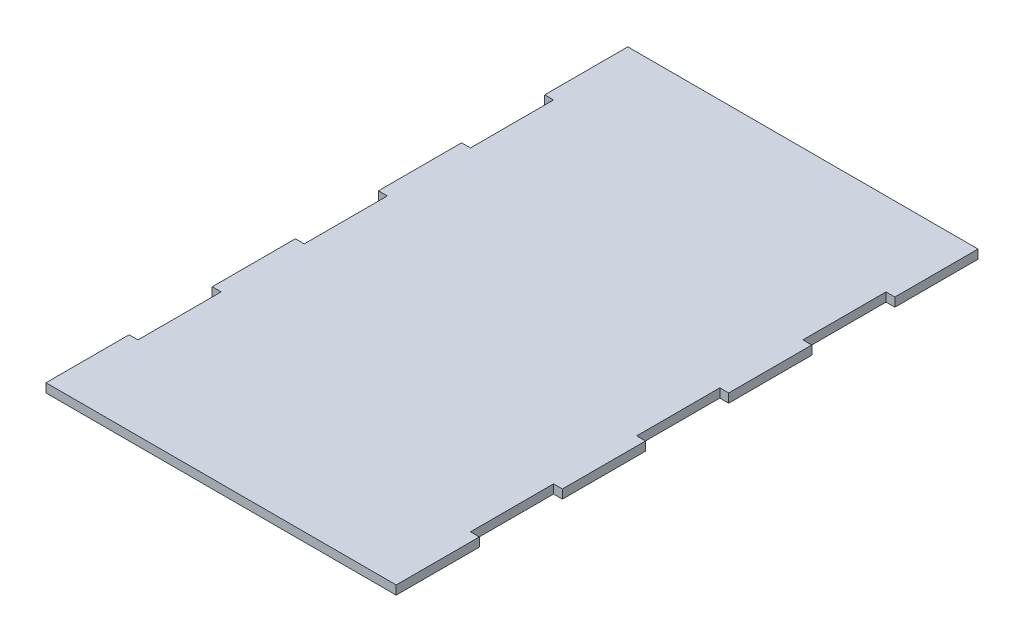
ISO-10303-21;
HEADER;
FILE_DESCRIPTION(('STEP AP214'),'2;1');
FILE_NAME('part.step','',(''),(''),'','','');
FILE_SCHEMA(('AUTOMOTIVE_DESIGN { 1 0 10303 214 1 1 1 1 }'));
ENDSEC;
DATA;
#1=APPLICATION_CONTEXT('core data for automotive mechanical design processes');
#2=APPLICATION_PROTOCOL_DEFINITION('international standard','automotive_design',2000,#1);
#3=PRODUCT_CONTEXT('',#1,'mechanical');
#4=PRODUCT('Part','Part','',(#3));
#5=PRODUCT_RELATED_PRODUCT_CATEGORY('part','',(#4));
#6=PRODUCT_DEFINITION_FORMATION('','',#4);
#7=PRODUCT_DEFINITION_CONTEXT('part definition',#1,'design');
#8=PRODUCT_DEFINITION('design','',#6,#7);
#9=PRODUCT_DEFINITION_SHAPE('','',#8);
#10=(LENGTH_UNIT() NAMED_UNIT(*) SI_UNIT(.MILLI.,.METRE.));
#11=(NAMED_UNIT(*) PLANE_ANGLE_UNIT() SI_UNIT($,.RADIAN.));
#12=(NAMED_UNIT(*) SI_UNIT($,.STERADIAN.) SOLID_ANGLE_UNIT());
#13=UNCERTAINTY_MEASURE_WITH_UNIT(LENGTH_MEASURE(1.E-05),#10,'distance_accuracy_value','');
#14=(GEOMETRIC_REPRESENTATION_CONTEXT(3) GLOBAL_UNCERTAINTY_ASSIGNED_CONTEXT((#13)) GLOBAL_UNIT_ASSIGNED_CONTEXT((#10,
#11,#12)) REPRESENTATION_CONTEXT('',''));
#15=CARTESIAN_POINT('',(0.,0.,0.));
#16=DIRECTION('',(0.,0.,1.));
#17=DIRECTION('',(1.,0.,0.));
#18=AXIS2_PLACEMENT_3D('',#15,#16,#17);
#19=CARTESIAN_POINT('',(0.,10.16,0.));
#20=DIRECTION('',(0.,0.,-1.));
#21=DIRECTION('',(-1.,0.,0.));
#22=AXIS2_PLACEMENT_3D('',#19,#20,#21);
#23=PLANE('',#22);
#24=DIRECTION('',(1.,0.,0.));
#25=VECTOR('',#24,1.);
#26=CARTESIAN_POINT('',(0.,0.,0.));
#27=LINE('',#26,#25);
#28=CARTESIAN_POINT('',(0.,0.,0.));
#29=VERTEX_POINT('',#28);
#30=CARTESIAN_POINT('',(401.32,0.,0.));
#31=VERTEX_POINT('',#30);
#32=EDGE_CURVE('E256',#29,#31,#27,.T.);
#33=ORIENTED_EDGE('',*,*,#32,.T.);
#34=DIRECTION('',(0.,-1.,0.));
#35=VECTOR('',#34,1.);
#36=CARTESIAN_POINT('',(401.32,10.16,0.));
#37=LINE('',#36,#35);
#38=CARTESIAN_POINT('',(401.32,10.16,0.));
#39=VERTEX_POINT('',#38);
#40=EDGE_CURVE('E11',#39,#31,#37,.T.);
#41=ORIENTED_EDGE('',*,*,#40,.F.);
#42=DIRECTION('',(1.,0.,0.));
#43=VECTOR('',#42,1.);
#44=CARTESIAN_POINT('',(0.,10.16,0.));
#45=LINE('',#44,#43);
#46=CARTESIAN_POINT('',(0.,10.16,0.));
#47=VERTEX_POINT('',#46);
#48=EDGE_CURVE('E323',#47,#39,#45,.T.);
#49=ORIENTED_EDGE('',*,*,#48,.F.);
#50=DIRECTION('',(0.,-1.,0.));
#51=VECTOR('',#50,1.);
#52=CARTESIAN_POINT('',(0.,10.16,0.));
#53=LINE('',#52,#51);
#54=EDGE_CURVE('E51',#47,#29,#53,.T.);
#55=ORIENTED_EDGE('',*,*,#54,.T.);
#56=EDGE_LOOP('',(#33,#41,#49,#55));
#57=FACE_BOUND('',#56,.T.);
#58=ADVANCED_FACE('F35',(#57),#23,.F.);
#59=CARTESIAN_POINT('',(401.32,10.16,0.));
#60=DIRECTION('',(-1.,0.,0.));
#61=DIRECTION('',(0.,0.,1.));
#62=AXIS2_PLACEMENT_3D('',#59,#60,#61);
#63=PLANE('',#62);
#64=DIRECTION('',(0.,0.,-1.));
#65=VECTOR('',#64,1.);
#66=CARTESIAN_POINT('',(401.32,0.,0.));
#67=LINE('',#66,#65);
#68=CARTESIAN_POINT('',(401.32,0.,-95.2500000000001));
#69=VERTEX_POINT('',#68);
#70=EDGE_CURVE('E258',#31,#69,#67,.T.);
#71=ORIENTED_EDGE('',*,*,#70,.T.);
#72=DIRECTION('',(0.,-1.,0.));
#73=VECTOR('',#72,1.);
#74=CARTESIAN_POINT('',(401.32,10.16,-95.2500000000001));
#75=LINE('',#74,#73);
#76=CARTESIAN_POINT('',(401.32,10.16,-95.2500000000001));
#77=VERTEX_POINT('',#76);
#78=EDGE_CURVE('E43',#77,#69,#75,.T.);
#79=ORIENTED_EDGE('',*,*,#78,.F.);
#80=DIRECTION('',(0.,0.,-1.));
#81=VECTOR('',#80,1.);
#82=CARTESIAN_POINT('',(401.32,10.16,0.));
#83=LINE('',#82,#81);
#84=EDGE_CURVE('E149',#39,#77,#83,.T.);
#85=ORIENTED_EDGE('',*,*,#84,.F.);
#86=ORIENTED_EDGE('',*,*,#40,.T.);
#87=EDGE_LOOP('',(#71,#79,#85,#86));
#88=FACE_BOUND('',#87,.T.);
#89=ADVANCED_FACE('F467',(#88),#63,.F.);
#90=CARTESIAN_POINT('',(-1.30104260698259E-13,10.16,-95.2499999999995));
#91=DIRECTION('',(0.,0.,1.));
#92=DIRECTION('',(1.,0.,0.));
#93=AXIS2_PLACEMENT_3D('',#90,#91,#92);
#94=PLANE('',#93);
#95=DIRECTION('',(-1.,0.,0.));
#96=VECTOR('',#95,1.);
#97=CARTESIAN_POINT('',(-1.30104260698259E-13,0.,-95.2499999999995));
#98=LINE('',#97,#96);
#99=CARTESIAN_POINT('',(391.16,0.,-95.25));
#100=VERTEX_POINT('',#99);
#101=EDGE_CURVE('E260',#69,#100,#98,.T.);
#102=ORIENTED_EDGE('',*,*,#101,.T.);
#103=DIRECTION('',(0.,-1.,0.));
#104=VECTOR('',#103,1.);
#105=CARTESIAN_POINT('',(391.16,10.16,-95.25));
#106=LINE('',#105,#104);
#107=CARTESIAN_POINT('',(391.16,10.16,-95.25));
#108=VERTEX_POINT('',#107);
#109=EDGE_CURVE('E373',#108,#100,#106,.T.);
#110=ORIENTED_EDGE('',*,*,#109,.F.);
#111=DIRECTION('',(-1.,0.,0.));
#112=VECTOR('',#111,1.);
#113=CARTESIAN_POINT('',(-1.30104260698259E-13,10.16,-95.2499999999995));
#114=LINE('',#113,#112);
#115=EDGE_CURVE('E380',#77,#108,#114,.T.);
#116=ORIENTED_EDGE('',*,*,#115,.F.);
#117=ORIENTED_EDGE('',*,*,#78,.T.);
#118=EDGE_LOOP('',(#102,#110,#116,#117));
#119=FACE_BOUND('',#118,.T.);
#120=ADVANCED_FACE('F378',(#119),#94,.F.);
#121=CARTESIAN_POINT('',(391.16,10.16,0.));
#122=DIRECTION('',(1.,0.,0.));
#123=DIRECTION('',(0.,0.,-1.));
#124=AXIS2_PLACEMENT_3D('',#121,#122,#123);
#125=PLANE('',#124);
#126=DIRECTION('',(0.,0.,1.));
#127=VECTOR('',#126,1.);
#128=CARTESIAN_POINT('',(391.16,0.,0.));
#129=LINE('',#128,#127);
#130=CARTESIAN_POINT('',(391.16,0.,-190.5));
#131=VERTEX_POINT('',#130);
#132=EDGE_CURVE('E263',#131,#100,#129,.T.);
#133=ORIENTED_EDGE('',*,*,#132,.F.);
#134=DIRECTION('',(0.,-1.,0.));
#135=VECTOR('',#134,1.);
#136=CARTESIAN_POINT('',(391.16,10.16,-190.5));
#137=LINE('',#136,#135);
#138=CARTESIAN_POINT('',(391.16,10.16,-190.5));
#139=VERTEX_POINT('',#138);
#140=EDGE_CURVE('E371',#139,#131,#137,.T.);
#141=ORIENTED_EDGE('',*,*,#140,.F.);
#142=DIRECTION('',(0.,0.,1.));
#143=VECTOR('',#142,1.);
#144=CARTESIAN_POINT('',(391.16,10.16,0.));
#145=LINE('',#144,#143);
#146=EDGE_CURVE('E390',#139,#108,#145,.T.);
#147=ORIENTED_EDGE('',*,*,#146,.T.);
#148=ORIENTED_EDGE('',*,*,#109,.T.);
#149=EDGE_LOOP('',(#133,#141,#147,#148));
#150=FACE_BOUND('',#149,.T.);
#151=ADVANCED_FACE('F387',(#150),#125,.T.);
#152=CARTESIAN_POINT('',(0.,10.16,-190.5));
#153=DIRECTION('',(0.,0.,1.));
#154=DIRECTION('',(1.,0.,0.));
#155=AXIS2_PLACEMENT_3D('',#152,#153,#154);
#156=PLANE('',#155);
#157=DIRECTION('',(-1.,0.,0.));
#158=VECTOR('',#157,1.);
#159=CARTESIAN_POINT('',(0.,0.,-190.5));
#160=LINE('',#159,#158);
#161=CARTESIAN_POINT('',(401.32,0.,-190.5));
#162=VERTEX_POINT('',#161);
#163=EDGE_CURVE('E266',#162,#131,#160,.T.);
#164=ORIENTED_EDGE('',*,*,#163,.F.);
#165=DIRECTION('',(0.,-1.,0.));
#166=VECTOR('',#165,1.);
#167=CARTESIAN_POINT('',(401.32,10.16,-190.5));
#168=LINE('',#167,#166);
#169=CARTESIAN_POINT('',(401.32,10.16,-190.5));
#170=VERTEX_POINT('',#169);
#171=EDGE_CURVE('E369',#170,#162,#168,.T.);
#172=ORIENTED_EDGE('',*,*,#171,.F.);
#173=DIRECTION('',(-1.,0.,0.));
#174=VECTOR('',#173,1.);
#175=CARTESIAN_POINT('',(0.,10.16,-190.5));
#176=LINE('',#175,#174);
#177=EDGE_CURVE('E393',#170,#139,#176,.T.);
#178=ORIENTED_EDGE('',*,*,#177,.T.);
#179=ORIENTED_EDGE('',*,*,#140,.T.);
#180=EDGE_LOOP('',(#164,#172,#178,#179));
#181=FACE_BOUND('',#180,.T.);
#182=ADVANCED_FACE('F720',(#181),#156,.T.);
#183=CARTESIAN_POINT('',(401.32,10.16,0.));
#184=DIRECTION('',(-1.,0.,0.));
#185=DIRECTION('',(0.,0.,1.));
#186=AXIS2_PLACEMENT_3D('',#183,#184,#185);
#187=PLANE('',#186);
#188=DIRECTION('',(0.,0.,-1.));
#189=VECTOR('',#188,1.);
#190=CARTESIAN_POINT('',(401.32,0.,0.));
#191=LINE('',#190,#189);
#192=CARTESIAN_POINT('',(401.32,0.,-285.75));
#193=VERTEX_POINT('',#192);
#194=EDGE_CURVE('E271',#162,#193,#191,.T.);
#195=ORIENTED_EDGE('',*,*,#194,.T.);
#196=DIRECTION('',(0.,-1.,0.));
#197=VECTOR('',#196,1.);
#198=CARTESIAN_POINT('',(401.32,10.16,-285.75));
#199=LINE('',#198,#197);
#200=CARTESIAN_POINT('',(401.32,10.16,-285.75));
#201=VERTEX_POINT('',#200);
#202=EDGE_CURVE('E366',#201,#193,#199,.T.);
#203=ORIENTED_EDGE('',*,*,#202,.F.);
#204=DIRECTION('',(0.,0.,-1.));
#205=VECTOR('',#204,1.);
#206=CARTESIAN_POINT('',(401.32,10.16,0.));
#207=LINE('',#206,#205);
#208=EDGE_CURVE('E397',#170,#201,#207,.T.);
#209=ORIENTED_EDGE('',*,*,#208,.F.);
#210=ORIENTED_EDGE('',*,*,#171,.T.);
#211=EDGE_LOOP('',(#195,#203,#209,#210));
#212=FACE_BOUND('',#211,.T.);
#213=ADVANCED_FACE('F708',(#212),#187,.F.);
#214=CARTESIAN_POINT('',(0.,10.16,-285.75));
#215=DIRECTION('',(0.,0.,1.));
#216=DIRECTION('',(1.,0.,0.));
#217=AXIS2_PLACEMENT_3D('',#214,#215,#216);
#218=PLANE('',#217);
#219=DIRECTION('',(-1.,0.,0.));
#220=VECTOR('',#219,1.);
#221=CARTESIAN_POINT('',(0.,0.,-285.75));
#222=LINE('',#221,#220);
#223=CARTESIAN_POINT('',(391.16,0.,-285.75));
#224=VERTEX_POINT('',#223);
#225=EDGE_CURVE('E273',#193,#224,#222,.T.);
#226=ORIENTED_EDGE('',*,*,#225,.T.);
#227=DIRECTION('',(0.,-1.,0.));
#228=VECTOR('',#227,1.);
#229=CARTESIAN_POINT('',(391.16,10.16,-285.75));
#230=LINE('',#229,#228);
#231=CARTESIAN_POINT('',(391.16,10.16,-285.75));
#232=VERTEX_POINT('',#231);
#233=EDGE_CURVE('E364',#232,#224,#230,.T.);
#234=ORIENTED_EDGE('',*,*,#233,.F.);
#235=DIRECTION('',(-1.,0.,0.));
#236=VECTOR('',#235,1.);
#237=CARTESIAN_POINT('',(0.,10.16,-285.75));
#238=LINE('',#237,#236);
#239=EDGE_CURVE('E405',#201,#232,#238,.T.);
#240=ORIENTED_EDGE('',*,*,#239,.F.);
#241=ORIENTED_EDGE('',*,*,#202,.T.);
#242=EDGE_LOOP('',(#226,#234,#240,#241));
#243=FACE_BOUND('',#242,.T.);
#244=ADVANCED_FACE('F699',(#243),#218,.F.);
#245=CARTESIAN_POINT('',(391.16,0.,-381.));
#246=VERTEX_POINT('',#245);
#247=EDGE_CURVE('E268',#246,#224,#129,.T.);
#248=ORIENTED_EDGE('',*,*,#247,.F.);
#249=DIRECTION('',(0.,-1.,0.));
#250=VECTOR('',#249,1.);
#251=CARTESIAN_POINT('',(391.16,10.16,-381.));
#252=LINE('',#251,#250);
#253=CARTESIAN_POINT('',(391.16,10.16,-381.));
#254=VERTEX_POINT('',#253);
#255=EDGE_CURVE('E362',#254,#246,#252,.T.);
#256=ORIENTED_EDGE('',*,*,#255,.F.);
#257=EDGE_CURVE('E396',#254,#232,#145,.T.);
#258=ORIENTED_EDGE('',*,*,#257,.T.);
#259=ORIENTED_EDGE('',*,*,#233,.T.);
#260=EDGE_LOOP('',(#248,#256,#258,#259));
#261=FACE_BOUND('',#260,.T.);
#262=ADVANCED_FACE('F656',(#261),#125,.T.);
#263=CARTESIAN_POINT('',(0.,10.16,-381.));
#264=DIRECTION('',(0.,0.,1.));
#265=DIRECTION('',(1.,0.,0.));
#266=AXIS2_PLACEMENT_3D('',#263,#264,#265);
#267=PLANE('',#266);
#268=DIRECTION('',(-1.,0.,0.));
#269=VECTOR('',#268,1.);
#270=CARTESIAN_POINT('',(0.,0.,-381.));
#271=LINE('',#270,#269);
#272=CARTESIAN_POINT('',(401.32,0.,-381.));
#273=VERTEX_POINT('',#272);
#274=EDGE_CURVE('E276',#273,#246,#271,.T.);
#275=ORIENTED_EDGE('',*,*,#274,.F.);
#276=DIRECTION('',(0.,-1.,0.));
#277=VECTOR('',#276,1.);
#278=CARTESIAN_POINT('',(401.32,10.16,-381.));
#279=LINE('',#278,#277);
#280=CARTESIAN_POINT('',(401.32,10.16,-381.));
#281=VERTEX_POINT('',#280);
#282=EDGE_CURVE('E360',#281,#273,#279,.T.);
#283=ORIENTED_EDGE('',*,*,#282,.F.);
#284=DIRECTION('',(-1.,0.,0.));
#285=VECTOR('',#284,1.);
#286=CARTESIAN_POINT('',(0.,10.16,-381.));
#287=LINE('',#286,#285);
#288=EDGE_CURVE('E404',#281,#254,#287,.T.);
#289=ORIENTED_EDGE('',*,*,#288,.T.);
#290=ORIENTED_EDGE('',*,*,#255,.T.);
#291=EDGE_LOOP('',(#275,#283,#289,#290));
#292=FACE_BOUND('',#291,.T.);
#293=ADVANCED_FACE('F677',(#292),#267,.T.);
#294=CARTESIAN_POINT('',(401.32,10.16,0.));
#295=DIRECTION('',(-1.,0.,0.));
#296=DIRECTION('',(0.,0.,1.));
#297=AXIS2_PLACEMENT_3D('',#294,#295,#296);
#298=PLANE('',#297);
#299=DIRECTION('',(0.,0.,-1.));
#300=VECTOR('',#299,1.);
#301=CARTESIAN_POINT('',(401.32,0.,0.));
#302=LINE('',#301,#300);
#303=CARTESIAN_POINT('',(401.32,0.,-476.25));
#304=VERTEX_POINT('',#303);
#305=EDGE_CURVE('E279',#273,#304,#302,.T.);
#306=ORIENTED_EDGE('',*,*,#305,.T.);
#307=DIRECTION('',(0.,-1.,0.));
#308=VECTOR('',#307,1.);
#309=CARTESIAN_POINT('',(401.32,10.16,-476.25));
#310=LINE('',#309,#308);
#311=CARTESIAN_POINT('',(401.32,10.16,-476.25));
#312=VERTEX_POINT('',#311);
#313=EDGE_CURVE('E357',#312,#304,#310,.T.);
#314=ORIENTED_EDGE('',*,*,#313,.F.);
#315=DIRECTION('',(0.,0.,-1.));
#316=VECTOR('',#315,1.);
#317=CARTESIAN_POINT('',(401.32,10.16,0.));
#318=LINE('',#317,#316);
#319=EDGE_CURVE('E409',#281,#312,#318,.T.);
#320=ORIENTED_EDGE('',*,*,#319,.F.);
#321=ORIENTED_EDGE('',*,*,#282,.T.);
#322=EDGE_LOOP('',(#306,#314,#320,#321));
#323=FACE_BOUND('',#322,.T.);
#324=ADVANCED_FACE('F665',(#323),#298,.F.);
#325=CARTESIAN_POINT('',(0.,10.16,-476.25));
#326=DIRECTION('',(0.,0.,1.));
#327=DIRECTION('',(1.,0.,0.));
#328=AXIS2_PLACEMENT_3D('',#325,#326,#327);
#329=PLANE('',#328);
#330=DIRECTION('',(-1.,0.,0.));
#331=VECTOR('',#330,1.);
#332=CARTESIAN_POINT('',(0.,0.,-476.25));
#333=LINE('',#332,#331);
#334=CARTESIAN_POINT('',(391.16,0.,-476.25));
#335=VERTEX_POINT('',#334);
#336=EDGE_CURVE('E281',#304,#335,#333,.T.);
#337=ORIENTED_EDGE('',*,*,#336,.T.);
#338=DIRECTION('',(0.,-1.,0.));
#339=VECTOR('',#338,1.);
#340=CARTESIAN_POINT('',(391.16,10.16,-476.25));
#341=LINE('',#340,#339);
#342=CARTESIAN_POINT('',(391.16,10.16,-476.25));
#343=VERTEX_POINT('',#342);
#344=EDGE_CURVE('E355',#343,#335,#341,.T.);
#345=ORIENTED_EDGE('',*,*,#344,.F.);
#346=DIRECTION('',(-1.,0.,0.));
#347=VECTOR('',#346,1.);
#348=CARTESIAN_POINT('',(0.,10.16,-476.25));
#349=LINE('',#348,#347);
#350=EDGE_CURVE('E402',#312,#343,#349,.T.);
#351=ORIENTED_EDGE('',*,*,#350,.F.);
#352=ORIENTED_EDGE('',*,*,#313,.T.);
#353=EDGE_LOOP('',(#337,#345,#351,#352));
#354=FACE_BOUND('',#353,.T.);
#355=ADVANCED_FACE('F653',(#354),#329,.F.);
#356=CARTESIAN_POINT('',(391.16,0.,-571.5));
#357=VERTEX_POINT('',#356);
#358=EDGE_CURVE('E267',#357,#335,#129,.T.);
#359=ORIENTED_EDGE('',*,*,#358,.F.);
#360=DIRECTION('',(0.,-1.,0.));
#361=VECTOR('',#360,1.);
#362=CARTESIAN_POINT('',(391.16,10.16,-571.5));
#363=LINE('',#362,#361);
#364=CARTESIAN_POINT('',(391.16,10.16,-571.5));
#365=VERTEX_POINT('',#364);
#366=EDGE_CURVE('E353',#365,#357,#363,.T.);
#367=ORIENTED_EDGE('',*,*,#366,.F.);
#368=EDGE_CURVE('E395',#365,#343,#145,.T.);
#369=ORIENTED_EDGE('',*,*,#368,.T.);
#370=ORIENTED_EDGE('',*,*,#344,.T.);
#371=EDGE_LOOP('',(#359,#367,#369,#370));
#372=FACE_BOUND('',#371,.T.);
#373=ADVANCED_FACE('F641',(#372),#125,.T.);
#374=CARTESIAN_POINT('',(0.,10.16,-571.5));
#375=DIRECTION('',(0.,0.,1.));
#376=DIRECTION('',(1.,0.,0.));
#377=AXIS2_PLACEMENT_3D('',#374,#375,#376);
#378=PLANE('',#377);
#379=DIRECTION('',(-1.,0.,0.));
#380=VECTOR('',#379,1.);
#381=CARTESIAN_POINT('',(0.,0.,-571.5));
#382=LINE('',#381,#380);
#383=CARTESIAN_POINT('',(401.32,0.,-571.5));
#384=VERTEX_POINT('',#383);
#385=EDGE_CURVE('E284',#384,#357,#382,.T.);
#386=ORIENTED_EDGE('',*,*,#385,.F.);
#387=DIRECTION('',(0.,-1.,0.));
#388=VECTOR('',#387,1.);
#389=CARTESIAN_POINT('',(401.32,10.16,-571.5));
#390=LINE('',#389,#388);
#391=CARTESIAN_POINT('',(401.32,10.16,-571.5));
#392=VERTEX_POINT('',#391);
#393=EDGE_CURVE('E351',#392,#384,#390,.T.);
#394=ORIENTED_EDGE('',*,*,#393,.F.);
#395=DIRECTION('',(-1.,0.,0.));
#396=VECTOR('',#395,1.);
#397=CARTESIAN_POINT('',(0.,10.16,-571.5));
#398=LINE('',#397,#396);
#399=EDGE_CURVE('E401',#392,#365,#398,.T.);
#400=ORIENTED_EDGE('',*,*,#399,.T.);
#401=ORIENTED_EDGE('',*,*,#366,.T.);
#402=EDGE_LOOP('',(#386,#394,#400,#401));
#403=FACE_BOUND('',#402,.T.);
#404=ADVANCED_FACE('F629',(#403),#378,.T.);
#405=CARTESIAN_POINT('',(401.32,10.16,0.));
#406=DIRECTION('',(-1.,0.,0.));
#407=DIRECTION('',(0.,0.,1.));
#408=AXIS2_PLACEMENT_3D('',#405,#406,#407);
#409=PLANE('',#408);
#410=DIRECTION('',(0.,0.,-1.));
#411=VECTOR('',#410,1.);
#412=CARTESIAN_POINT('',(401.32,0.,0.));
#413=LINE('',#412,#411);
#414=CARTESIAN_POINT('',(401.32,0.,-666.75));
#415=VERTEX_POINT('',#414);
#416=EDGE_CURVE('E287',#384,#415,#413,.T.);
#417=ORIENTED_EDGE('',*,*,#416,.T.);
#418=DIRECTION('',(0.,-1.,0.));
#419=VECTOR('',#418,1.);
#420=CARTESIAN_POINT('',(401.32,10.16,-666.75));
#421=LINE('',#420,#419);
#422=CARTESIAN_POINT('',(401.32,10.16,-666.75));
#423=VERTEX_POINT('',#422);
#424=EDGE_CURVE('E349',#423,#415,#421,.T.);
#425=ORIENTED_EDGE('',*,*,#424,.F.);
#426=DIRECTION('',(0.,0.,-1.));
#427=VECTOR('',#426,1.);
#428=CARTESIAN_POINT('',(401.32,10.16,0.));
#429=LINE('',#428,#427);
#430=EDGE_CURVE('E420',#392,#423,#429,.T.);
#431=ORIENTED_EDGE('',*,*,#430,.F.);
#432=ORIENTED_EDGE('',*,*,#393,.T.);
#433=EDGE_LOOP('',(#417,#425,#431,#432));
#434=FACE_BOUND('',#433,.T.);
#435=ADVANCED_FACE('F618',(#434),#409,.F.);
#436=CARTESIAN_POINT('',(0.,10.16,-666.75));
#437=DIRECTION('',(0.,0.,-1.));
#438=DIRECTION('',(-1.,0.,0.));
#439=AXIS2_PLACEMENT_3D('',#436,#437,#438);
#440=PLANE('',#439);
#441=DIRECTION('',(1.,0.,0.));
#442=VECTOR('',#441,1.);
#443=CARTESIAN_POINT('',(0.,0.,-666.75));
#444=LINE('',#443,#442);
#445=CARTESIAN_POINT('',(0.,0.,-666.75));
#446=VERTEX_POINT('',#445);
#447=EDGE_CURVE('E290',#446,#415,#444,.T.);
#448=ORIENTED_EDGE('',*,*,#447,.F.);
#449=DIRECTION('',(0.,-1.,0.));
#450=VECTOR('',#449,1.);
#451=CARTESIAN_POINT('',(0.,10.16,-666.75));
#452=LINE('',#451,#450);
#453=CARTESIAN_POINT('',(0.,10.16,-666.75));
#454=VERTEX_POINT('',#453);
#455=EDGE_CURVE('E347',#454,#446,#452,.T.);
#456=ORIENTED_EDGE('',*,*,#455,.F.);
#457=DIRECTION('',(1.,0.,0.));
#458=VECTOR('',#457,1.);
#459=CARTESIAN_POINT('',(0.,10.16,-666.75));
#460=LINE('',#459,#458);
#461=EDGE_CURVE('E422',#454,#423,#460,.T.);
#462=ORIENTED_EDGE('',*,*,#461,.T.);
#463=ORIENTED_EDGE('',*,*,#424,.T.);
#464=EDGE_LOOP('',(#448,#456,#462,#463));
#465=FACE_BOUND('',#464,.T.);
#466=ADVANCED_FACE('F607',(#465),#440,.T.);
#467=CARTESIAN_POINT('',(0.,10.16,0.));
#468=DIRECTION('',(-1.,0.,0.));
#469=DIRECTION('',(0.,0.,1.));
#470=AXIS2_PLACEMENT_3D('',#467,#468,#469);
#471=PLANE('',#470);
#472=DIRECTION('',(0.,0.,-1.));
#473=VECTOR('',#472,1.);
#474=CARTESIAN_POINT('',(0.,0.,0.));
#475=LINE('',#474,#473);
#476=CARTESIAN_POINT('',(0.,0.,-571.5));
#477=VERTEX_POINT('',#476);
#478=EDGE_CURVE('E293',#477,#446,#475,.T.);
#479=ORIENTED_EDGE('',*,*,#478,.F.);
#480=DIRECTION('',(0.,-1.,0.));
#481=VECTOR('',#480,1.);
#482=CARTESIAN_POINT('',(0.,10.16,-571.5));
#483=LINE('',#482,#481);
#484=CARTESIAN_POINT('',(0.,10.16,-571.5));
#485=VERTEX_POINT('',#484);
#486=EDGE_CURVE('E345',#485,#477,#483,.T.);
#487=ORIENTED_EDGE('',*,*,#486,.F.);
#488=DIRECTION('',(0.,0.,-1.));
#489=VECTOR('',#488,1.);
#490=CARTESIAN_POINT('',(0.,10.16,0.));
#491=LINE('',#490,#489);
#492=EDGE_CURVE('E425',#485,#454,#491,.T.);
#493=ORIENTED_EDGE('',*,*,#492,.T.);
#494=ORIENTED_EDGE('',*,*,#455,.T.);
#495=EDGE_LOOP('',(#479,#487,#493,#494));
#496=FACE_BOUND('',#495,.T.);
#497=ADVANCED_FACE('F595',(#496),#471,.T.);
#498=CARTESIAN_POINT('',(0.,10.16,-571.5));
#499=DIRECTION('',(0.,0.,-1.));
#500=DIRECTION('',(-1.,0.,0.));
#501=AXIS2_PLACEMENT_3D('',#498,#499,#500);
#502=PLANE('',#501);
#503=DIRECTION('',(1.,0.,0.));
#504=VECTOR('',#503,1.);
#505=CARTESIAN_POINT('',(0.,0.,-571.5));
#506=LINE('',#505,#504);
#507=CARTESIAN_POINT('',(10.16,0.,-571.5));
#508=VERTEX_POINT('',#507);
#509=EDGE_CURVE('E296',#477,#508,#506,.T.);
#510=ORIENTED_EDGE('',*,*,#509,.T.);
#511=DIRECTION('',(0.,-1.,0.));
#512=VECTOR('',#511,1.);
#513=CARTESIAN_POINT('',(10.16,10.16,-571.5));
#514=LINE('',#513,#512);
#515=CARTESIAN_POINT('',(10.16,10.16,-571.5));
#516=VERTEX_POINT('',#515);
#517=EDGE_CURVE('E342',#516,#508,#514,.T.);
#518=ORIENTED_EDGE('',*,*,#517,.F.);
#519=DIRECTION('',(1.,0.,0.));
#520=VECTOR('',#519,1.);
#521=CARTESIAN_POINT('',(0.,10.16,-571.5));
#522=LINE('',#521,#520);
#523=EDGE_CURVE('E428',#485,#516,#522,.T.);
#524=ORIENTED_EDGE('',*,*,#523,.F.);
#525=ORIENTED_EDGE('',*,*,#486,.T.);
#526=EDGE_LOOP('',(#510,#518,#524,#525));
#527=FACE_BOUND('',#526,.T.);
#528=ADVANCED_FACE('F585',(#527),#502,.F.);
#529=CARTESIAN_POINT('',(10.1600000000001,10.16,0.));
#530=DIRECTION('',(1.,0.,0.));
#531=DIRECTION('',(0.,0.,-1.));
#532=AXIS2_PLACEMENT_3D('',#529,#530,#531);
#533=PLANE('',#532);
#534=DIRECTION('',(0.,0.,1.));
#535=VECTOR('',#534,1.);
#536=CARTESIAN_POINT('',(10.1600000000001,0.,0.));
#537=LINE('',#536,#535);
#538=CARTESIAN_POINT('',(10.16,0.,-476.25));
#539=VERTEX_POINT('',#538);
#540=EDGE_CURVE('E298',#508,#539,#537,.T.);
#541=ORIENTED_EDGE('',*,*,#540,.T.);
#542=DIRECTION('',(0.,-1.,0.));
#543=VECTOR('',#542,1.);
#544=CARTESIAN_POINT('',(10.16,10.16,-476.25));
#545=LINE('',#544,#543);
#546=CARTESIAN_POINT('',(10.16,10.16,-476.25));
#547=VERTEX_POINT('',#546);
#548=EDGE_CURVE('E340',#547,#539,#545,.T.);
#549=ORIENTED_EDGE('',*,*,#548,.F.);
#550=DIRECTION('',(0.,0.,1.));
#551=VECTOR('',#550,1.);
#552=CARTESIAN_POINT('',(10.1600000000001,10.16,0.));
#553=LINE('',#552,#551);
#554=EDGE_CURVE('E239',#516,#547,#553,.T.);
#555=ORIENTED_EDGE('',*,*,#554,.F.);
#556=ORIENTED_EDGE('',*,*,#517,.T.);
#557=EDGE_LOOP('',(#541,#549,#555,#556));
#558=FACE_BOUND('',#557,.T.);
#559=ADVANCED_FACE('F463',(#558),#533,.F.);
#560=CARTESIAN_POINT('',(0.,10.16,-476.25));
#561=DIRECTION('',(0.,0.,-1.));
#562=DIRECTION('',(-1.,0.,0.));
#563=AXIS2_PLACEMENT_3D('',#560,#561,#562);
#564=PLANE('',#563);
#565=DIRECTION('',(1.,0.,0.));
#566=VECTOR('',#565,1.);
#567=CARTESIAN_POINT('',(0.,0.,-476.25));
#568=LINE('',#567,#566);
#569=CARTESIAN_POINT('',(0.,0.,-476.25));
#570=VERTEX_POINT('',#569);
#571=EDGE_CURVE('E301',#570,#539,#568,.T.);
#572=ORIENTED_EDGE('',*,*,#571,.F.);
#573=DIRECTION('',(0.,-1.,0.));
#574=VECTOR('',#573,1.);
#575=CARTESIAN_POINT('',(0.,10.16,-476.25));
#576=LINE('',#575,#574);
#577=CARTESIAN_POINT('',(0.,10.16,-476.25));
#578=VERTEX_POINT('',#577);
#579=EDGE_CURVE('E338',#578,#570,#576,.T.);
#580=ORIENTED_EDGE('',*,*,#579,.F.);
#581=DIRECTION('',(1.,0.,0.));
#582=VECTOR('',#581,1.);
#583=CARTESIAN_POINT('',(0.,10.16,-476.25));
#584=LINE('',#583,#582);
#585=EDGE_CURVE('E430',#578,#547,#584,.T.);
#586=ORIENTED_EDGE('',*,*,#585,.T.);
#587=ORIENTED_EDGE('',*,*,#548,.T.);
#588=EDGE_LOOP('',(#572,#580,#586,#587));
#589=FACE_BOUND('',#588,.T.);
#590=ADVANCED_FACE('F564',(#589),#564,.T.);
#591=CARTESIAN_POINT('',(0.,10.16,0.));
#592=DIRECTION('',(-1.,0.,0.));
#593=DIRECTION('',(0.,0.,1.));
#594=AXIS2_PLACEMENT_3D('',#591,#592,#593);
#595=PLANE('',#594);
#596=DIRECTION('',(0.,0.,-1.));
#597=VECTOR('',#596,1.);
#598=CARTESIAN_POINT('',(0.,0.,0.));
#599=LINE('',#598,#597);
#600=CARTESIAN_POINT('',(0.,0.,-381.));
#601=VERTEX_POINT('',#600);
#602=EDGE_CURVE('E305',#601,#570,#599,.T.);
#603=ORIENTED_EDGE('',*,*,#602,.F.);
#604=DIRECTION('',(0.,-1.,0.));
#605=VECTOR('',#604,1.);
#606=CARTESIAN_POINT('',(0.,10.16,-381.));
#607=LINE('',#606,#605);
#608=CARTESIAN_POINT('',(0.,10.16,-381.));
#609=VERTEX_POINT('',#608);
#610=EDGE_CURVE('E336',#609,#601,#607,.T.);
#611=ORIENTED_EDGE('',*,*,#610,.F.);
#612=DIRECTION('',(0.,0.,-1.));
#613=VECTOR('',#612,1.);
#614=CARTESIAN_POINT('',(0.,10.16,0.));
#615=LINE('',#614,#613);
#616=EDGE_CURVE('E433',#609,#578,#615,.T.);
#617=ORIENTED_EDGE('',*,*,#616,.T.);
#618=ORIENTED_EDGE('',*,*,#579,.T.);
#619=EDGE_LOOP('',(#603,#611,#617,#618));
#620=FACE_BOUND('',#619,.T.);
#621=ADVANCED_FACE('F552',(#620),#595,.T.);
#622=CARTESIAN_POINT('',(0.,10.16,-381.));
#623=DIRECTION('',(0.,0.,-1.));
#624=DIRECTION('',(-1.,0.,0.));
#625=AXIS2_PLACEMENT_3D('',#622,#623,#624);
#626=PLANE('',#625);
#627=DIRECTION('',(1.,0.,0.));
#628=VECTOR('',#627,1.);
#629=CARTESIAN_POINT('',(0.,0.,-381.));
#630=LINE('',#629,#628);
#631=CARTESIAN_POINT('',(10.16,0.,-381.));
#632=VERTEX_POINT('',#631);
#633=EDGE_CURVE('E308',#601,#632,#630,.T.);
#634=ORIENTED_EDGE('',*,*,#633,.T.);
#635=DIRECTION('',(0.,-1.,0.));
#636=VECTOR('',#635,1.);
#637=CARTESIAN_POINT('',(10.16,10.16,-381.));
#638=LINE('',#637,#636);
#639=CARTESIAN_POINT('',(10.16,10.16,-381.));
#640=VERTEX_POINT('',#639);
#641=EDGE_CURVE('E333',#640,#632,#638,.T.);
#642=ORIENTED_EDGE('',*,*,#641,.F.);
#643=DIRECTION('',(1.,0.,0.));
#644=VECTOR('',#643,1.);
#645=CARTESIAN_POINT('',(0.,10.16,-381.));
#646=LINE('',#645,#644);
#647=EDGE_CURVE('E436',#609,#640,#646,.T.);
#648=ORIENTED_EDGE('',*,*,#647,.F.);
#649=ORIENTED_EDGE('',*,*,#610,.T.);
#650=EDGE_LOOP('',(#634,#642,#648,#649));
#651=FACE_BOUND('',#650,.T.);
#652=ADVANCED_FACE('F542',(#651),#626,.F.);
#653=CARTESIAN_POINT('',(10.16,0.,-285.75));
#654=VERTEX_POINT('',#653);
#655=EDGE_CURVE('E302',#632,#654,#537,.T.);
#656=ORIENTED_EDGE('',*,*,#655,.T.);
#657=DIRECTION('',(0.,-1.,0.));
#658=VECTOR('',#657,1.);
#659=CARTESIAN_POINT('',(10.16,10.16,-285.75));
#660=LINE('',#659,#658);
#661=CARTESIAN_POINT('',(10.16,10.16,-285.75));
#662=VERTEX_POINT('',#661);
#663=EDGE_CURVE('E331',#662,#654,#660,.T.);
#664=ORIENTED_EDGE('',*,*,#663,.F.);
#665=EDGE_CURVE('E238',#640,#662,#553,.T.);
#666=ORIENTED_EDGE('',*,*,#665,.F.);
#667=ORIENTED_EDGE('',*,*,#641,.T.);
#668=EDGE_LOOP('',(#656,#664,#666,#667));
#669=FACE_BOUND('',#668,.T.);
#670=ADVANCED_FACE('F464',(#669),#533,.F.);
#671=CARTESIAN_POINT('',(0.,10.16,-285.75));
#672=DIRECTION('',(0.,0.,-1.));
#673=DIRECTION('',(-1.,0.,0.));
#674=AXIS2_PLACEMENT_3D('',#671,#672,#673);
#675=PLANE('',#674);
#676=DIRECTION('',(1.,0.,0.));
#677=VECTOR('',#676,1.);
#678=CARTESIAN_POINT('',(0.,0.,-285.75));
#679=LINE('',#678,#677);
#680=CARTESIAN_POINT('',(0.,0.,-285.75));
#681=VERTEX_POINT('',#680);
#682=EDGE_CURVE('E310',#681,#654,#679,.T.);
#683=ORIENTED_EDGE('',*,*,#682,.F.);
#684=DIRECTION('',(0.,-1.,0.));
#685=VECTOR('',#684,1.);
#686=CARTESIAN_POINT('',(0.,10.16,-285.75));
#687=LINE('',#686,#685);
#688=CARTESIAN_POINT('',(0.,10.16,-285.75));
#689=VERTEX_POINT('',#688);
#690=EDGE_CURVE('E329',#689,#681,#687,.T.);
#691=ORIENTED_EDGE('',*,*,#690,.F.);
#692=DIRECTION('',(1.,0.,0.));
#693=VECTOR('',#692,1.);
#694=CARTESIAN_POINT('',(0.,10.16,-285.75));
#695=LINE('',#694,#693);
#696=EDGE_CURVE('E438',#689,#662,#695,.T.);
#697=ORIENTED_EDGE('',*,*,#696,.T.);
#698=ORIENTED_EDGE('',*,*,#663,.T.);
#699=EDGE_LOOP('',(#683,#691,#697,#698));
#700=FACE_BOUND('',#699,.T.);
#701=ADVANCED_FACE('F450',(#700),#675,.T.);
#702=CARTESIAN_POINT('',(0.,10.16,0.));
#703=DIRECTION('',(-1.,0.,0.));
#704=DIRECTION('',(0.,0.,1.));
#705=AXIS2_PLACEMENT_3D('',#702,#703,#704);
#706=PLANE('',#705);
#707=DIRECTION('',(0.,0.,-1.));
#708=VECTOR('',#707,1.);
#709=CARTESIAN_POINT('',(0.,0.,0.));
#710=LINE('',#709,#708);
#711=CARTESIAN_POINT('',(0.,0.,-190.5));
#712=VERTEX_POINT('',#711);
#713=EDGE_CURVE('E313',#712,#681,#710,.T.);
#714=ORIENTED_EDGE('',*,*,#713,.F.);
#715=DIRECTION('',(0.,-1.,0.));
#716=VECTOR('',#715,1.);
#717=CARTESIAN_POINT('',(0.,10.16,-190.5));
#718=LINE('',#717,#716);
#719=CARTESIAN_POINT('',(0.,10.16,-190.5));
#720=VERTEX_POINT('',#719);
#721=EDGE_CURVE('E327',#720,#712,#718,.T.);
#722=ORIENTED_EDGE('',*,*,#721,.F.);
#723=DIRECTION('',(0.,0.,-1.));
#724=VECTOR('',#723,1.);
#725=CARTESIAN_POINT('',(0.,10.16,0.));
#726=LINE('',#725,#724);
#727=EDGE_CURVE('E440',#720,#689,#726,.T.);
#728=ORIENTED_EDGE('',*,*,#727,.T.);
#729=ORIENTED_EDGE('',*,*,#690,.T.);
#730=EDGE_LOOP('',(#714,#722,#728,#729));
#731=FACE_BOUND('',#730,.T.);
#732=ADVANCED_FACE('F444',(#731),#706,.T.);
#733=CARTESIAN_POINT('',(0.,10.16,-190.5));
#734=DIRECTION('',(0.,0.,-1.));
#735=DIRECTION('',(-1.,0.,0.));
#736=AXIS2_PLACEMENT_3D('',#733,#734,#735);
#737=PLANE('',#736);
#738=DIRECTION('',(1.,0.,0.));
#739=VECTOR('',#738,1.);
#740=CARTESIAN_POINT('',(0.,0.,-190.5));
#741=LINE('',#740,#739);
#742=CARTESIAN_POINT('',(10.16,0.,-190.5));
#743=VERTEX_POINT('',#742);
#744=EDGE_CURVE('E316',#712,#743,#741,.T.);
#745=ORIENTED_EDGE('',*,*,#744,.T.);
#746=DIRECTION('',(0.,-1.,0.));
#747=VECTOR('',#746,1.);
#748=CARTESIAN_POINT('',(10.16,10.16,-190.5));
#749=LINE('',#748,#747);
#750=CARTESIAN_POINT('',(10.16,10.16,-190.5));
#751=VERTEX_POINT('',#750);
#752=EDGE_CURVE('E247',#751,#743,#749,.T.);
#753=ORIENTED_EDGE('',*,*,#752,.F.);
#754=DIRECTION('',(1.,0.,0.));
#755=VECTOR('',#754,1.);
#756=CARTESIAN_POINT('',(0.,10.16,-190.5));
#757=LINE('',#756,#755);
#758=EDGE_CURVE('E233',#720,#751,#757,.T.);
#759=ORIENTED_EDGE('',*,*,#758,.F.);
#760=ORIENTED_EDGE('',*,*,#721,.T.);
#761=EDGE_LOOP('',(#745,#753,#759,#760));
#762=FACE_BOUND('',#761,.T.);
#763=ADVANCED_FACE('F455',(#762),#737,.F.);
#764=CARTESIAN_POINT('',(10.16,0.,-95.25));
#765=VERTEX_POINT('',#764);
#766=EDGE_CURVE('E244',#743,#765,#537,.T.);
#767=ORIENTED_EDGE('',*,*,#766,.T.);
#768=DIRECTION('',(0.,-1.,0.));
#769=VECTOR('',#768,1.);
#770=CARTESIAN_POINT('',(10.16,10.16,-95.25));
#771=LINE('',#770,#769);
#772=CARTESIAN_POINT('',(10.16,10.16,-95.25));
#773=VERTEX_POINT('',#772);
#774=EDGE_CURVE('E241',#773,#765,#771,.T.);
#775=ORIENTED_EDGE('',*,*,#774,.F.);
#776=EDGE_CURVE('E225',#751,#773,#553,.T.);
#777=ORIENTED_EDGE('',*,*,#776,.F.);
#778=ORIENTED_EDGE('',*,*,#752,.T.);
#779=EDGE_LOOP('',(#767,#775,#777,#778));
#780=FACE_BOUND('',#779,.T.);
#781=ADVANCED_FACE('F242',(#780),#533,.F.);
#782=CARTESIAN_POINT('',(0.,10.16,-95.25));
#783=DIRECTION('',(0.,0.,-1.));
#784=DIRECTION('',(-1.,0.,0.));
#785=AXIS2_PLACEMENT_3D('',#782,#783,#784);
#786=PLANE('',#785);
#787=DIRECTION('',(1.,0.,0.));
#788=VECTOR('',#787,1.);
#789=CARTESIAN_POINT('',(0.,0.,-95.25));
#790=LINE('',#789,#788);
#791=CARTESIAN_POINT('',(0.,0.,-95.25));
#792=VERTEX_POINT('',#791);
#793=EDGE_CURVE('E318',#792,#765,#790,.T.);
#794=ORIENTED_EDGE('',*,*,#793,.F.);
#795=DIRECTION('',(0.,-1.,0.));
#796=VECTOR('',#795,1.);
#797=CARTESIAN_POINT('',(0.,10.16,-95.25));
#798=LINE('',#797,#796);
#799=CARTESIAN_POINT('',(0.,10.16,-95.25));
#800=VERTEX_POINT('',#799);
#801=EDGE_CURVE('E137',#800,#792,#798,.T.);
#802=ORIENTED_EDGE('',*,*,#801,.F.);
#803=DIRECTION('',(1.,0.,0.));
#804=VECTOR('',#803,1.);
#805=CARTESIAN_POINT('',(0.,10.16,-95.25));
#806=LINE('',#805,#804);
#807=EDGE_CURVE('E230',#800,#773,#806,.T.);
#808=ORIENTED_EDGE('',*,*,#807,.T.);
#809=ORIENTED_EDGE('',*,*,#774,.T.);
#810=EDGE_LOOP('',(#794,#802,#808,#809));
#811=FACE_BOUND('',#810,.T.);
#812=ADVANCED_FACE('F249',(#811),#786,.T.);
#813=CARTESIAN_POINT('',(0.,10.16,0.));
#814=DIRECTION('',(-1.,0.,0.));
#815=DIRECTION('',(0.,0.,1.));
#816=AXIS2_PLACEMENT_3D('',#813,#814,#815);
#817=PLANE('',#816);
#818=DIRECTION('',(0.,0.,-1.));
#819=VECTOR('',#818,1.);
#820=CARTESIAN_POINT('',(0.,0.,0.));
#821=LINE('',#820,#819);
#822=EDGE_CURVE('E320',#29,#792,#821,.T.);
#823=ORIENTED_EDGE('',*,*,#822,.F.);
#824=ORIENTED_EDGE('',*,*,#54,.F.);
#825=DIRECTION('',(0.,0.,-1.));
#826=VECTOR('',#825,1.);
#827=CARTESIAN_POINT('',(0.,10.16,0.));
#828=LINE('',#827,#826);
#829=EDGE_CURVE('E250',#47,#800,#828,.T.);
#830=ORIENTED_EDGE('',*,*,#829,.T.);
#831=ORIENTED_EDGE('',*,*,#801,.T.);
#832=EDGE_LOOP('',(#823,#824,#830,#831));
#833=FACE_BOUND('',#832,.T.);
#834=ADVANCED_FACE('F472',(#833),#817,.T.);
#835=CARTESIAN_POINT('',(0.,10.16,0.));
#836=DIRECTION('',(0.,1.,0.));
#837=DIRECTION('',(0.,0.,1.));
#838=AXIS2_PLACEMENT_3D('',#835,#836,#837);
#839=PLANE('',#838);
#840=ORIENTED_EDGE('',*,*,#48,.T.);
#841=ORIENTED_EDGE('',*,*,#84,.T.);
#842=ORIENTED_EDGE('',*,*,#115,.T.);
#843=ORIENTED_EDGE('',*,*,#146,.F.);
#844=ORIENTED_EDGE('',*,*,#177,.F.);
#845=ORIENTED_EDGE('',*,*,#208,.T.);
#846=ORIENTED_EDGE('',*,*,#239,.T.);
#847=ORIENTED_EDGE('',*,*,#257,.F.);
#848=ORIENTED_EDGE('',*,*,#288,.F.);
#849=ORIENTED_EDGE('',*,*,#319,.T.);
#850=ORIENTED_EDGE('',*,*,#350,.T.);
#851=ORIENTED_EDGE('',*,*,#368,.F.);
#852=ORIENTED_EDGE('',*,*,#399,.F.);
#853=ORIENTED_EDGE('',*,*,#430,.T.);
#854=ORIENTED_EDGE('',*,*,#461,.F.);
#855=ORIENTED_EDGE('',*,*,#492,.F.);
#856=ORIENTED_EDGE('',*,*,#523,.T.);
#857=ORIENTED_EDGE('',*,*,#554,.T.);
#858=ORIENTED_EDGE('',*,*,#585,.F.);
#859=ORIENTED_EDGE('',*,*,#616,.F.);
#860=ORIENTED_EDGE('',*,*,#647,.T.);
#861=ORIENTED_EDGE('',*,*,#665,.T.);
#862=ORIENTED_EDGE('',*,*,#696,.F.);
#863=ORIENTED_EDGE('',*,*,#727,.F.);
#864=ORIENTED_EDGE('',*,*,#758,.T.);
#865=ORIENTED_EDGE('',*,*,#776,.T.);
#866=ORIENTED_EDGE('',*,*,#807,.F.);
#867=ORIENTED_EDGE('',*,*,#829,.F.);
#868=EDGE_LOOP('',(#840,#841,#842,#843,#844,#845,#846,#847,#848,#849,#850,#851,#852,#853,#854,
#855,#856,#857,#858,#859,#860,#861,#862,#863,#864,#865,#866,#867));
#869=FACE_BOUND('',#868,.T.);
#870=ADVANCED_FACE('F227',(#869),#839,.T.);
#871=CARTESIAN_POINT('',(0.,0.,0.));
#872=DIRECTION('',(0.,1.,0.));
#873=DIRECTION('',(0.,0.,1.));
#874=AXIS2_PLACEMENT_3D('',#871,#872,#873);
#875=PLANE('',#874);
#876=ORIENTED_EDGE('',*,*,#32,.F.);
#877=ORIENTED_EDGE('',*,*,#822,.T.);
#878=ORIENTED_EDGE('',*,*,#793,.T.);
#879=ORIENTED_EDGE('',*,*,#766,.F.);
#880=ORIENTED_EDGE('',*,*,#744,.F.);
#881=ORIENTED_EDGE('',*,*,#713,.T.);
#882=ORIENTED_EDGE('',*,*,#682,.T.);
#883=ORIENTED_EDGE('',*,*,#655,.F.);
#884=ORIENTED_EDGE('',*,*,#633,.F.);
#885=ORIENTED_EDGE('',*,*,#602,.T.);
#886=ORIENTED_EDGE('',*,*,#571,.T.);
#887=ORIENTED_EDGE('',*,*,#540,.F.);
#888=ORIENTED_EDGE('',*,*,#509,.F.);
#889=ORIENTED_EDGE('',*,*,#478,.T.);
#890=ORIENTED_EDGE('',*,*,#447,.T.);
#891=ORIENTED_EDGE('',*,*,#416,.F.);
#892=ORIENTED_EDGE('',*,*,#385,.T.);
#893=ORIENTED_EDGE('',*,*,#358,.T.);
#894=ORIENTED_EDGE('',*,*,#336,.F.);
#895=ORIENTED_EDGE('',*,*,#305,.F.);
#896=ORIENTED_EDGE('',*,*,#274,.T.);
#897=ORIENTED_EDGE('',*,*,#247,.T.);
#898=ORIENTED_EDGE('',*,*,#225,.F.);
#899=ORIENTED_EDGE('',*,*,#194,.F.);
#900=ORIENTED_EDGE('',*,*,#163,.T.);
#901=ORIENTED_EDGE('',*,*,#132,.T.);
#902=ORIENTED_EDGE('',*,*,#101,.F.);
#903=ORIENTED_EDGE('',*,*,#70,.F.);
#904=EDGE_LOOP('',(#876,#877,#878,#879,#880,#881,#882,#883,#884,#885,#886,#887,#888,#889,#890,
#891,#892,#893,#894,#895,#896,#897,#898,#899,#900,#901,#902,#903));
#905=FACE_BOUND('',#904,.T.);
#906=ADVANCED_FACE('F382',(#905),#875,.F.);
#907=CLOSED_SHELL('',(#58,#89,#120,#151,#182,#213,#244,#262,#293,#324,#355,#373,#404,#435,#466,
#497,#528,#559,#590,#621,#652,#670,#701,#732,#763,#781,#812,#834,#870,#906));
#908=MANIFOLD_SOLID_BREP('B2',#907);
#909=ADVANCED_BREP_SHAPE_REPRESENTATION('',(#18,#908),#14);
#910=SHAPE_DEFINITION_REPRESENTATION(#9,#909);
ENDSEC;
END-ISO-10303-21;
